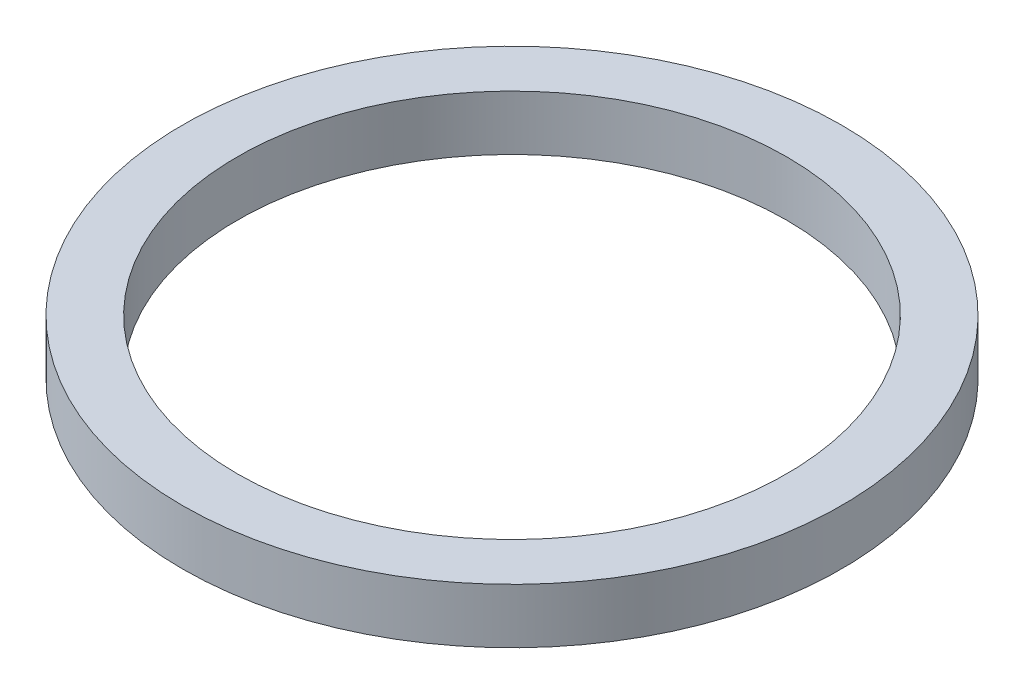
ISO-10303-21;
HEADER;
FILE_DESCRIPTION(('STEP AP214'),'2;1');
FILE_NAME('part.step','',(''),(''),'','','');
FILE_SCHEMA(('AUTOMOTIVE_DESIGN { 1 0 10303 214 1 1 1 1 }'));
ENDSEC;
DATA;
#1=APPLICATION_CONTEXT('core data for automotive mechanical design processes');
#2=APPLICATION_PROTOCOL_DEFINITION('international standard','automotive_design',2000,#1);
#3=PRODUCT_CONTEXT('',#1,'mechanical');
#4=PRODUCT('Part','Part','',(#3));
#5=PRODUCT_RELATED_PRODUCT_CATEGORY('part','',(#4));
#6=PRODUCT_DEFINITION_FORMATION('','',#4);
#7=PRODUCT_DEFINITION_CONTEXT('part definition',#1,'design');
#8=PRODUCT_DEFINITION('design','',#6,#7);
#9=PRODUCT_DEFINITION_SHAPE('','',#8);
#10=(LENGTH_UNIT() NAMED_UNIT(*) SI_UNIT(.MILLI.,.METRE.));
#11=(NAMED_UNIT(*) PLANE_ANGLE_UNIT() SI_UNIT($,.RADIAN.));
#12=(NAMED_UNIT(*) SI_UNIT($,.STERADIAN.) SOLID_ANGLE_UNIT());
#13=UNCERTAINTY_MEASURE_WITH_UNIT(LENGTH_MEASURE(1.E-05),#10,'distance_accuracy_value','');
#14=(GEOMETRIC_REPRESENTATION_CONTEXT(3) GLOBAL_UNCERTAINTY_ASSIGNED_CONTEXT((#13)) GLOBAL_UNIT_ASSIGNED_CONTEXT((#10,
#11,#12)) REPRESENTATION_CONTEXT('',''));
#15=CARTESIAN_POINT('',(0.,0.,0.));
#16=DIRECTION('',(0.,0.,1.));
#17=DIRECTION('',(1.,0.,0.));
#18=AXIS2_PLACEMENT_3D('',#15,#16,#17);
#19=CARTESIAN_POINT('',(0.,0.5,0.));
#20=DIRECTION('',(0.,1.,0.));
#21=DIRECTION('',(0.,0.,1.));
#22=AXIS2_PLACEMENT_3D('',#19,#20,#21);
#23=PLANE('',#22);
#24=CARTESIAN_POINT('',(0.,0.5,0.));
#25=DIRECTION('',(0.,1.,0.));
#26=DIRECTION('',(0.,0.,1.));
#27=AXIS2_PLACEMENT_3D('',#24,#25,#26);
#28=CIRCLE('',#27,3.);
#29=CARTESIAN_POINT('',(0.,0.5,3.));
#30=VERTEX_POINT('',#29);
#31=EDGE_CURVE('E10',#30,#30,#28,.T.);
#32=ORIENTED_EDGE('',*,*,#31,.T.);
#33=EDGE_LOOP('',(#32));
#34=FACE_BOUND('',#33,.T.);
#35=CARTESIAN_POINT('',(0.,0.5,0.));
#36=DIRECTION('',(0.,1.,0.));
#37=DIRECTION('',(0.,0.,1.));
#38=AXIS2_PLACEMENT_3D('',#35,#36,#37);
#39=CIRCLE('',#38,2.5);
#40=CARTESIAN_POINT('',(0.,0.5,2.5));
#41=VERTEX_POINT('',#40);
#42=EDGE_CURVE('E50',#41,#41,#39,.T.);
#43=ORIENTED_EDGE('',*,*,#42,.F.);
#44=EDGE_LOOP('',(#43));
#45=FACE_BOUND('',#44,.T.);
#46=ADVANCED_FACE('F37',(#34,#45),#23,.T.);
#47=CARTESIAN_POINT('',(0.,0.,0.));
#48=DIRECTION('',(0.,1.,0.));
#49=DIRECTION('',(0.,0.,1.));
#50=AXIS2_PLACEMENT_3D('',#47,#48,#49);
#51=PLANE('',#50);
#52=CARTESIAN_POINT('',(0.,0.,0.));
#53=DIRECTION('',(0.,1.,0.));
#54=DIRECTION('',(0.,0.,1.));
#55=AXIS2_PLACEMENT_3D('',#52,#53,#54);
#56=CIRCLE('',#55,3.);
#57=CARTESIAN_POINT('',(0.,0.,3.));
#58=VERTEX_POINT('',#57);
#59=EDGE_CURVE('E41',#58,#58,#56,.T.);
#60=ORIENTED_EDGE('',*,*,#59,.F.);
#61=EDGE_LOOP('',(#60));
#62=FACE_BOUND('',#61,.T.);
#63=CARTESIAN_POINT('',(0.,0.,0.));
#64=DIRECTION('',(0.,1.,0.));
#65=DIRECTION('',(0.,0.,1.));
#66=AXIS2_PLACEMENT_3D('',#63,#64,#65);
#67=CIRCLE('',#66,2.5);
#68=CARTESIAN_POINT('',(0.,0.,2.5));
#69=VERTEX_POINT('',#68);
#70=EDGE_CURVE('E52',#69,#69,#67,.T.);
#71=ORIENTED_EDGE('',*,*,#70,.T.);
#72=EDGE_LOOP('',(#71));
#73=FACE_BOUND('',#72,.T.);
#74=ADVANCED_FACE('F64',(#62,#73),#51,.F.);
#75=CARTESIAN_POINT('',(0.,0.5,0.));
#76=DIRECTION('',(0.,-1.,0.));
#77=DIRECTION('',(0.,0.,-1.));
#78=AXIS2_PLACEMENT_3D('',#75,#76,#77);
#79=CYLINDRICAL_SURFACE('',#78,3.);
#80=ORIENTED_EDGE('',*,*,#31,.F.);
#81=EDGE_LOOP('',(#80));
#82=FACE_BOUND('',#81,.T.);
#83=ORIENTED_EDGE('',*,*,#59,.T.);
#84=EDGE_LOOP('',(#83));
#85=FACE_BOUND('',#84,.T.);
#86=ADVANCED_FACE('F39',(#82,#85),#79,.T.);
#87=CARTESIAN_POINT('',(0.,0.5,0.));
#88=DIRECTION('',(0.,-1.,0.));
#89=DIRECTION('',(0.,0.,-1.));
#90=AXIS2_PLACEMENT_3D('',#87,#88,#89);
#91=CYLINDRICAL_SURFACE('',#90,2.5);
#92=ORIENTED_EDGE('',*,*,#42,.T.);
#93=EDGE_LOOP('',(#92));
#94=FACE_BOUND('',#93,.T.);
#95=ORIENTED_EDGE('',*,*,#70,.F.);
#96=EDGE_LOOP('',(#95));
#97=FACE_BOUND('',#96,.T.);
#98=ADVANCED_FACE('F60',(#94,#97),#91,.F.);
#99=CLOSED_SHELL('',(#46,#74,#86,#98));
#100=MANIFOLD_SOLID_BREP('B2',#99);
#101=ADVANCED_BREP_SHAPE_REPRESENTATION('',(#18,#100),#14);
#102=SHAPE_DEFINITION_REPRESENTATION(#9,#101);
ENDSEC;
END-ISO-10303-21;
